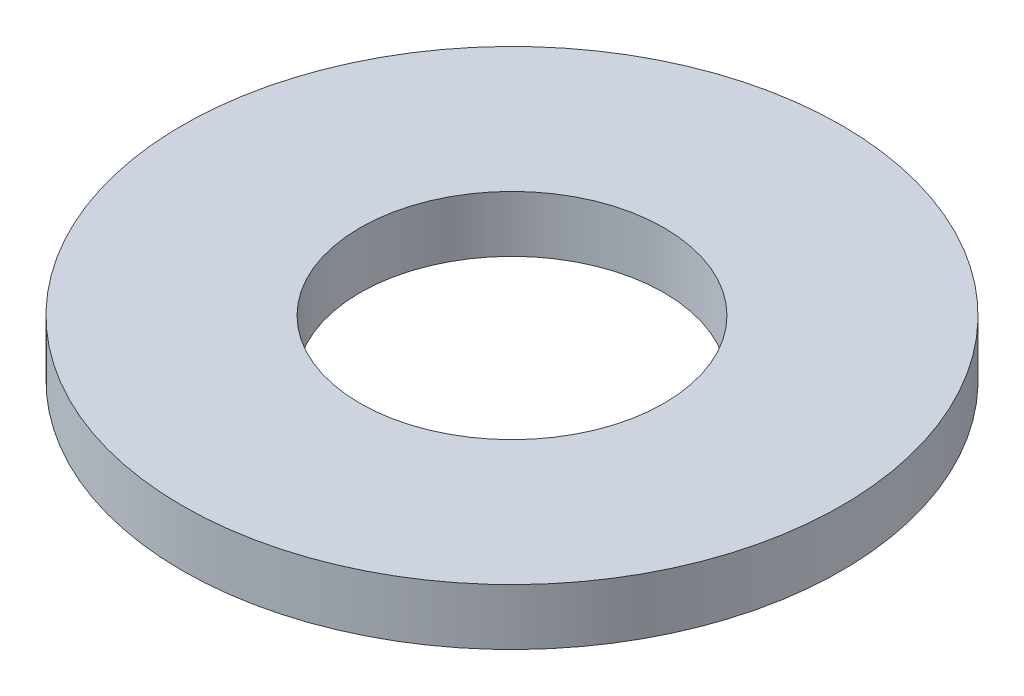
ISO-10303-21;
HEADER;
FILE_DESCRIPTION(('STEP AP214'),'2;1');
FILE_NAME('part.step','',(''),(''),'','','');
FILE_SCHEMA(('AUTOMOTIVE_DESIGN { 1 0 10303 214 1 1 1 1 }'));
ENDSEC;
DATA;
#1=APPLICATION_CONTEXT('core data for automotive mechanical design processes');
#2=APPLICATION_PROTOCOL_DEFINITION('international standard','automotive_design',2000,#1);
#3=PRODUCT_CONTEXT('',#1,'mechanical');
#4=PRODUCT('Part','Part','',(#3));
#5=PRODUCT_RELATED_PRODUCT_CATEGORY('part','',(#4));
#6=PRODUCT_DEFINITION_FORMATION('','',#4);
#7=PRODUCT_DEFINITION_CONTEXT('part definition',#1,'design');
#8=PRODUCT_DEFINITION('design','',#6,#7);
#9=PRODUCT_DEFINITION_SHAPE('','',#8);
#10=(LENGTH_UNIT() NAMED_UNIT(*) SI_UNIT(.MILLI.,.METRE.));
#11=(NAMED_UNIT(*) PLANE_ANGLE_UNIT() SI_UNIT($,.RADIAN.));
#12=(NAMED_UNIT(*) SI_UNIT($,.STERADIAN.) SOLID_ANGLE_UNIT());
#13=UNCERTAINTY_MEASURE_WITH_UNIT(LENGTH_MEASURE(1.E-05),#10,'distance_accuracy_value','');
#14=(GEOMETRIC_REPRESENTATION_CONTEXT(3) GLOBAL_UNCERTAINTY_ASSIGNED_CONTEXT((#13)) GLOBAL_UNIT_ASSIGNED_CONTEXT((#10,
#11,#12)) REPRESENTATION_CONTEXT('',''));
#15=CARTESIAN_POINT('',(0.,0.,0.));
#16=DIRECTION('',(0.,0.,1.));
#17=DIRECTION('',(1.,0.,0.));
#18=AXIS2_PLACEMENT_3D('',#15,#16,#17);
#19=CARTESIAN_POINT('',(0.,0.8128,0.));
#20=DIRECTION('',(0.,1.,0.));
#21=DIRECTION('',(0.,0.,1.));
#22=AXIS2_PLACEMENT_3D('',#19,#20,#21);
#23=PLANE('',#22);
#24=CARTESIAN_POINT('',(0.,0.8128,0.));
#25=DIRECTION('',(0.,-1.,0.));
#26=DIRECTION('',(0.,0.,-1.));
#27=AXIS2_PLACEMENT_3D('',#24,#25,#26);
#28=CIRCLE('',#27,2.1971);
#29=CARTESIAN_POINT('',(0.,0.8128,-2.1971));
#30=VERTEX_POINT('',#29);
#31=EDGE_CURVE('E25',#30,#30,#28,.T.);
#32=ORIENTED_EDGE('',*,*,#31,.T.);
#33=EDGE_LOOP('',(#32));
#34=FACE_BOUND('',#33,.T.);
#35=CARTESIAN_POINT('',(0.,0.8128,0.));
#36=DIRECTION('',(0.,-1.,0.));
#37=DIRECTION('',(0.,0.,-1.));
#38=AXIS2_PLACEMENT_3D('',#35,#36,#37);
#39=CIRCLE('',#38,4.7625);
#40=CARTESIAN_POINT('',(0.,0.8128,-4.7625));
#41=VERTEX_POINT('',#40);
#42=EDGE_CURVE('E16',#41,#41,#39,.T.);
#43=ORIENTED_EDGE('',*,*,#42,.F.);
#44=EDGE_LOOP('',(#43));
#45=FACE_BOUND('',#44,.T.);
#46=ADVANCED_FACE('F13',(#34,#45),#23,.T.);
#47=CARTESIAN_POINT('',(0.,0.8128,0.));
#48=DIRECTION('',(0.,-1.,0.));
#49=DIRECTION('',(0.,0.,-1.));
#50=AXIS2_PLACEMENT_3D('',#47,#48,#49);
#51=CYLINDRICAL_SURFACE('',#50,4.7625);
#52=ORIENTED_EDGE('',*,*,#42,.T.);
#53=EDGE_LOOP('',(#52));
#54=FACE_BOUND('',#53,.T.);
#55=CARTESIAN_POINT('',(0.,0.,0.));
#56=DIRECTION('',(0.,-1.,0.));
#57=DIRECTION('',(0.,0.,-1.));
#58=AXIS2_PLACEMENT_3D('',#55,#56,#57);
#59=CIRCLE('',#58,4.7625);
#60=CARTESIAN_POINT('',(0.,0.,-4.7625));
#61=VERTEX_POINT('',#60);
#62=EDGE_CURVE('E20',#61,#61,#59,.F.);
#63=ORIENTED_EDGE('',*,*,#62,.T.);
#64=EDGE_LOOP('',(#63));
#65=FACE_BOUND('',#64,.T.);
#66=ADVANCED_FACE('F33',(#54,#65),#51,.T.);
#67=CARTESIAN_POINT('',(0.,0.8128,0.));
#68=DIRECTION('',(0.,-1.,0.));
#69=DIRECTION('',(0.,0.,-1.));
#70=AXIS2_PLACEMENT_3D('',#67,#68,#69);
#71=CYLINDRICAL_SURFACE('',#70,2.1971);
#72=CARTESIAN_POINT('',(0.,0.,0.));
#73=DIRECTION('',(0.,-1.,0.));
#74=DIRECTION('',(0.,0.,-1.));
#75=AXIS2_PLACEMENT_3D('',#72,#73,#74);
#76=CIRCLE('',#75,2.1971);
#77=CARTESIAN_POINT('',(0.,0.,-2.1971));
#78=VERTEX_POINT('',#77);
#79=EDGE_CURVE('E9',#78,#78,#76,.T.);
#80=ORIENTED_EDGE('',*,*,#79,.T.);
#81=EDGE_LOOP('',(#80));
#82=FACE_BOUND('',#81,.T.);
#83=ORIENTED_EDGE('',*,*,#31,.F.);
#84=EDGE_LOOP('',(#83));
#85=FACE_BOUND('',#84,.T.);
#86=ADVANCED_FACE('F41',(#82,#85),#71,.F.);
#87=CARTESIAN_POINT('',(0.,0.,0.));
#88=DIRECTION('',(0.,1.,0.));
#89=DIRECTION('',(0.,0.,1.));
#90=AXIS2_PLACEMENT_3D('',#87,#88,#89);
#91=PLANE('',#90);
#92=ORIENTED_EDGE('',*,*,#79,.F.);
#93=EDGE_LOOP('',(#92));
#94=FACE_BOUND('',#93,.T.);
#95=ORIENTED_EDGE('',*,*,#62,.F.);
#96=EDGE_LOOP('',(#95));
#97=FACE_BOUND('',#96,.T.);
#98=ADVANCED_FACE('F42',(#94,#97),#91,.F.);
#99=CLOSED_SHELL('',(#46,#66,#86,#98));
#100=MANIFOLD_SOLID_BREP('B1',#99);
#101=ADVANCED_BREP_SHAPE_REPRESENTATION('',(#18,#100),#14);
#102=SHAPE_DEFINITION_REPRESENTATION(#9,#101);
ENDSEC;
END-ISO-10303-21;
